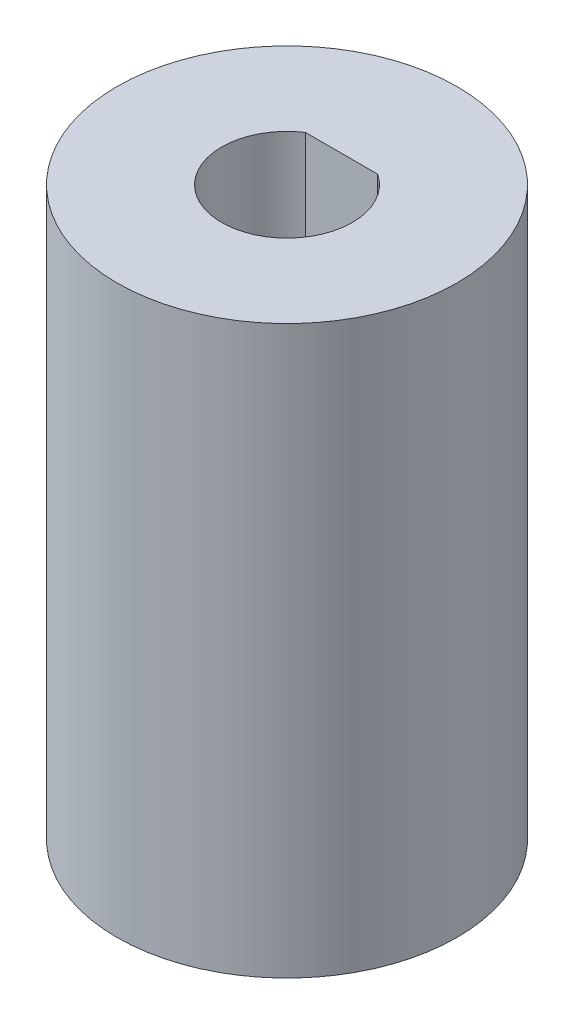
ISO-10303-21;
HEADER;
FILE_DESCRIPTION(('STEP AP214'),'2;1');
FILE_NAME('part.step','',(''),(''),'','','');
FILE_SCHEMA(('AUTOMOTIVE_DESIGN { 1 0 10303 214 1 1 1 1 }'));
ENDSEC;
DATA;
#1=APPLICATION_CONTEXT('core data for automotive mechanical design processes');
#2=APPLICATION_PROTOCOL_DEFINITION('international standard','automotive_design',2000,#1);
#3=PRODUCT_CONTEXT('',#1,'mechanical');
#4=PRODUCT('Part','Part','',(#3));
#5=PRODUCT_RELATED_PRODUCT_CATEGORY('part','',(#4));
#6=PRODUCT_DEFINITION_FORMATION('','',#4);
#7=PRODUCT_DEFINITION_CONTEXT('part definition',#1,'design');
#8=PRODUCT_DEFINITION('design','',#6,#7);
#9=PRODUCT_DEFINITION_SHAPE('','',#8);
#10=(LENGTH_UNIT() NAMED_UNIT(*) SI_UNIT(.MILLI.,.METRE.));
#11=(NAMED_UNIT(*) PLANE_ANGLE_UNIT() SI_UNIT($,.RADIAN.));
#12=(NAMED_UNIT(*) SI_UNIT($,.STERADIAN.) SOLID_ANGLE_UNIT());
#13=UNCERTAINTY_MEASURE_WITH_UNIT(LENGTH_MEASURE(1.E-05),#10,'distance_accuracy_value','');
#14=(GEOMETRIC_REPRESENTATION_CONTEXT(3) GLOBAL_UNCERTAINTY_ASSIGNED_CONTEXT((#13)) GLOBAL_UNIT_ASSIGNED_CONTEXT((#10,
#11,#12)) REPRESENTATION_CONTEXT('',''));
#15=CARTESIAN_POINT('',(0.,0.,0.));
#16=DIRECTION('',(0.,0.,1.));
#17=DIRECTION('',(1.,0.,0.));
#18=AXIS2_PLACEMENT_3D('',#15,#16,#17);
#19=CARTESIAN_POINT('',(0.,26.,0.));
#20=DIRECTION('',(0.,1.,0.));
#21=DIRECTION('',(0.,0.,1.));
#22=AXIS2_PLACEMENT_3D('',#19,#20,#21);
#23=PLANE('',#22);
#24=CARTESIAN_POINT('',(0.,26.,0.));
#25=DIRECTION('',(0.,1.,0.));
#26=DIRECTION('',(0.,0.,1.));
#27=AXIS2_PLACEMENT_3D('',#24,#25,#26);
#28=CIRCLE('',#27,7.8);
#29=CARTESIAN_POINT('',(0.,26.,7.8));
#30=VERTEX_POINT('',#29);
#31=EDGE_CURVE('E11',#30,#30,#28,.T.);
#32=ORIENTED_EDGE('',*,*,#31,.T.);
#33=EDGE_LOOP('',(#32));
#34=FACE_BOUND('',#33,.T.);
#35=DIRECTION('',(1.,0.,0.));
#36=VECTOR('',#35,1.);
#37=CARTESIAN_POINT('',(0.,26.,-2.5));
#38=LINE('',#37,#36);
#39=CARTESIAN_POINT('',(-1.6583123951777,26.,-2.5));
#40=VERTEX_POINT('',#39);
#41=CARTESIAN_POINT('',(1.6583123951777,26.,-2.5));
#42=VERTEX_POINT('',#41);
#43=EDGE_CURVE('E48',#40,#42,#38,.T.);
#44=ORIENTED_EDGE('',*,*,#43,.T.);
#45=CARTESIAN_POINT('',(0.,26.,0.));
#46=DIRECTION('',(0.,1.,0.));
#47=DIRECTION('',(0.,0.,1.));
#48=AXIS2_PLACEMENT_3D('',#45,#46,#47);
#49=CIRCLE('',#48,3.);
#50=EDGE_CURVE('E74',#40,#42,#49,.T.);
#51=ORIENTED_EDGE('',*,*,#50,.F.);
#52=EDGE_LOOP('',(#44,#51));
#53=FACE_BOUND('',#52,.T.);
#54=ADVANCED_FACE('F33',(#34,#53),#23,.T.);
#55=CARTESIAN_POINT('',(0.,0.,0.));
#56=DIRECTION('',(0.,1.,0.));
#57=DIRECTION('',(0.,0.,1.));
#58=AXIS2_PLACEMENT_3D('',#55,#56,#57);
#59=PLANE('',#58);
#60=CARTESIAN_POINT('',(0.,0.,0.));
#61=DIRECTION('',(0.,1.,0.));
#62=DIRECTION('',(0.,0.,1.));
#63=AXIS2_PLACEMENT_3D('',#60,#61,#62);
#64=CIRCLE('',#63,7.8);
#65=CARTESIAN_POINT('',(0.,0.,7.8));
#66=VERTEX_POINT('',#65);
#67=EDGE_CURVE('E37',#66,#66,#64,.T.);
#68=ORIENTED_EDGE('',*,*,#67,.F.);
#69=EDGE_LOOP('',(#68));
#70=FACE_BOUND('',#69,.T.);
#71=CARTESIAN_POINT('',(0.,0.,0.));
#72=DIRECTION('',(0.,1.,0.));
#73=DIRECTION('',(0.,0.,1.));
#74=AXIS2_PLACEMENT_3D('',#71,#72,#73);
#75=CIRCLE('',#74,3.);
#76=CARTESIAN_POINT('',(-1.6583123951777,0.,-2.5));
#77=VERTEX_POINT('',#76);
#78=CARTESIAN_POINT('',(1.6583123951777,0.,-2.5));
#79=VERTEX_POINT('',#78);
#80=EDGE_CURVE('E67',#77,#79,#75,.T.);
#81=ORIENTED_EDGE('',*,*,#80,.T.);
#82=DIRECTION('',(1.,0.,0.));
#83=VECTOR('',#82,1.);
#84=CARTESIAN_POINT('',(0.,0.,-2.5));
#85=LINE('',#84,#83);
#86=EDGE_CURVE('E53',#77,#79,#85,.T.);
#87=ORIENTED_EDGE('',*,*,#86,.F.);
#88=EDGE_LOOP('',(#81,#87));
#89=FACE_BOUND('',#88,.T.);
#90=ADVANCED_FACE('F71',(#70,#89),#59,.F.);
#91=CARTESIAN_POINT('',(0.,26.,0.));
#92=DIRECTION('',(0.,-1.,0.));
#93=DIRECTION('',(0.,0.,-1.));
#94=AXIS2_PLACEMENT_3D('',#91,#92,#93);
#95=CYLINDRICAL_SURFACE('',#94,7.8);
#96=ORIENTED_EDGE('',*,*,#31,.F.);
#97=EDGE_LOOP('',(#96));
#98=FACE_BOUND('',#97,.T.);
#99=ORIENTED_EDGE('',*,*,#67,.T.);
#100=EDGE_LOOP('',(#99));
#101=FACE_BOUND('',#100,.T.);
#102=ADVANCED_FACE('F35',(#98,#101),#95,.T.);
#103=CARTESIAN_POINT('',(0.,26.,-2.5));
#104=DIRECTION('',(0.,0.,-1.));
#105=DIRECTION('',(-1.,0.,0.));
#106=AXIS2_PLACEMENT_3D('',#103,#104,#105);
#107=PLANE('',#106);
#108=ORIENTED_EDGE('',*,*,#86,.T.);
#109=DIRECTION('',(0.,-1.,0.));
#110=VECTOR('',#109,1.);
#111=CARTESIAN_POINT('',(1.6583123951777,26.,-2.5));
#112=LINE('',#111,#110);
#113=EDGE_CURVE('E64',#42,#79,#112,.T.);
#114=ORIENTED_EDGE('',*,*,#113,.F.);
#115=ORIENTED_EDGE('',*,*,#43,.F.);
#116=DIRECTION('',(0.,-1.,0.));
#117=VECTOR('',#116,1.);
#118=CARTESIAN_POINT('',(-1.6583123951777,26.,-2.5));
#119=LINE('',#118,#117);
#120=EDGE_CURVE('E59',#40,#77,#119,.T.);
#121=ORIENTED_EDGE('',*,*,#120,.T.);
#122=EDGE_LOOP('',(#108,#114,#115,#121));
#123=FACE_BOUND('',#122,.T.);
#124=ADVANCED_FACE('F61',(#123),#107,.F.);
#125=CARTESIAN_POINT('',(0.,26.,0.));
#126=DIRECTION('',(0.,-1.,0.));
#127=DIRECTION('',(0.,0.,-1.));
#128=AXIS2_PLACEMENT_3D('',#125,#126,#127);
#129=CYLINDRICAL_SURFACE('',#128,3.);
#130=ORIENTED_EDGE('',*,*,#80,.F.);
#131=ORIENTED_EDGE('',*,*,#120,.F.);
#132=ORIENTED_EDGE('',*,*,#50,.T.);
#133=ORIENTED_EDGE('',*,*,#113,.T.);
#134=EDGE_LOOP('',(#130,#131,#132,#133));
#135=FACE_BOUND('',#134,.T.);
#136=ADVANCED_FACE('F68',(#135),#129,.F.);
#137=CLOSED_SHELL('',(#54,#90,#102,#124,#136));
#138=MANIFOLD_SOLID_BREP('B2',#137);
#139=ADVANCED_BREP_SHAPE_REPRESENTATION('',(#18,#138),#14);
#140=SHAPE_DEFINITION_REPRESENTATION(#9,#139);
ENDSEC;
END-ISO-10303-21;
